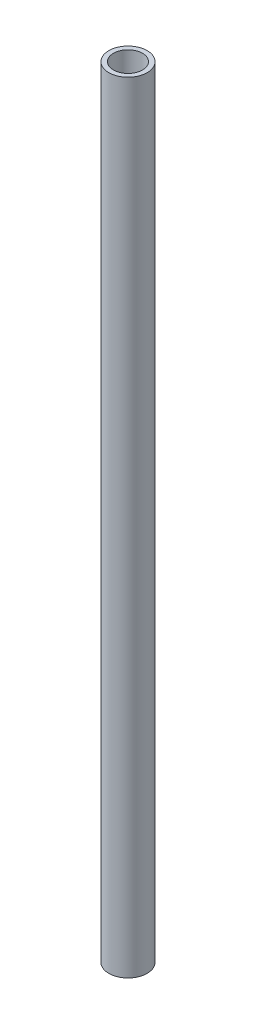
ISO-10303-21;
HEADER;
FILE_DESCRIPTION(('STEP AP214'),'2;1');
FILE_NAME('part.step','',(''),(''),'','','');
FILE_SCHEMA(('AUTOMOTIVE_DESIGN { 1 0 10303 214 1 1 1 1 }'));
ENDSEC;
DATA;
#1=APPLICATION_CONTEXT('core data for automotive mechanical design processes');
#2=APPLICATION_PROTOCOL_DEFINITION('international standard','automotive_design',2000,#1);
#3=PRODUCT_CONTEXT('',#1,'mechanical');
#4=PRODUCT('Part','Part','',(#3));
#5=PRODUCT_RELATED_PRODUCT_CATEGORY('part','',(#4));
#6=PRODUCT_DEFINITION_FORMATION('','',#4);
#7=PRODUCT_DEFINITION_CONTEXT('part definition',#1,'design');
#8=PRODUCT_DEFINITION('design','',#6,#7);
#9=PRODUCT_DEFINITION_SHAPE('','',#8);
#10=(LENGTH_UNIT() NAMED_UNIT(*) SI_UNIT(.MILLI.,.METRE.));
#11=(NAMED_UNIT(*) PLANE_ANGLE_UNIT() SI_UNIT($,.RADIAN.));
#12=(NAMED_UNIT(*) SI_UNIT($,.STERADIAN.) SOLID_ANGLE_UNIT());
#13=UNCERTAINTY_MEASURE_WITH_UNIT(LENGTH_MEASURE(1.E-05),#10,'distance_accuracy_value','');
#14=(GEOMETRIC_REPRESENTATION_CONTEXT(3) GLOBAL_UNCERTAINTY_ASSIGNED_CONTEXT((#13)) GLOBAL_UNIT_ASSIGNED_CONTEXT((#10,
#11,#12)) REPRESENTATION_CONTEXT('',''));
#15=CARTESIAN_POINT('',(0.,0.,0.));
#16=DIRECTION('',(0.,0.,1.));
#17=DIRECTION('',(1.,0.,0.));
#18=AXIS2_PLACEMENT_3D('',#15,#16,#17);
#19=CARTESIAN_POINT('',(0.,550.,0.));
#20=DIRECTION('',(0.,1.,0.));
#21=DIRECTION('',(0.,0.,1.));
#22=AXIS2_PLACEMENT_3D('',#19,#20,#21);
#23=PLANE('',#22);
#24=CARTESIAN_POINT('',(0.,550.,0.));
#25=DIRECTION('',(0.,1.,0.));
#26=DIRECTION('',(0.,0.,1.));
#27=AXIS2_PLACEMENT_3D('',#24,#25,#26);
#28=CIRCLE('',#27,13.5);
#29=CARTESIAN_POINT('',(0.,550.,13.5));
#30=VERTEX_POINT('',#29);
#31=EDGE_CURVE('E10',#30,#30,#28,.T.);
#32=ORIENTED_EDGE('',*,*,#31,.T.);
#33=EDGE_LOOP('',(#32));
#34=FACE_BOUND('',#33,.T.);
#35=CARTESIAN_POINT('',(0.,550.,0.));
#36=DIRECTION('',(0.,1.,0.));
#37=DIRECTION('',(0.,0.,1.));
#38=AXIS2_PLACEMENT_3D('',#35,#36,#37);
#39=CIRCLE('',#38,10.25);
#40=CARTESIAN_POINT('',(0.,550.,10.25));
#41=VERTEX_POINT('',#40);
#42=EDGE_CURVE('E41',#41,#41,#39,.T.);
#43=ORIENTED_EDGE('',*,*,#42,.F.);
#44=EDGE_LOOP('',(#43));
#45=FACE_BOUND('',#44,.T.);
#46=ADVANCED_FACE('F30',(#34,#45),#23,.T.);
#47=CARTESIAN_POINT('',(0.,0.,0.));
#48=DIRECTION('',(0.,1.,0.));
#49=DIRECTION('',(0.,0.,1.));
#50=AXIS2_PLACEMENT_3D('',#47,#48,#49);
#51=PLANE('',#50);
#52=CARTESIAN_POINT('',(0.,0.,0.));
#53=DIRECTION('',(0.,1.,0.));
#54=DIRECTION('',(0.,0.,1.));
#55=AXIS2_PLACEMENT_3D('',#52,#53,#54);
#56=CIRCLE('',#55,13.5);
#57=CARTESIAN_POINT('',(0.,0.,13.5));
#58=VERTEX_POINT('',#57);
#59=EDGE_CURVE('E34',#58,#58,#56,.T.);
#60=ORIENTED_EDGE('',*,*,#59,.F.);
#61=EDGE_LOOP('',(#60));
#62=FACE_BOUND('',#61,.T.);
#63=CARTESIAN_POINT('',(0.,0.,0.));
#64=DIRECTION('',(0.,1.,0.));
#65=DIRECTION('',(0.,0.,1.));
#66=AXIS2_PLACEMENT_3D('',#63,#64,#65);
#67=CIRCLE('',#66,10.25);
#68=CARTESIAN_POINT('',(0.,0.,10.25));
#69=VERTEX_POINT('',#68);
#70=EDGE_CURVE('E43',#69,#69,#67,.T.);
#71=ORIENTED_EDGE('',*,*,#70,.T.);
#72=EDGE_LOOP('',(#71));
#73=FACE_BOUND('',#72,.T.);
#74=ADVANCED_FACE('F53',(#62,#73),#51,.F.);
#75=CARTESIAN_POINT('',(0.,550.,0.));
#76=DIRECTION('',(0.,-1.,0.));
#77=DIRECTION('',(0.,0.,-1.));
#78=AXIS2_PLACEMENT_3D('',#75,#76,#77);
#79=CYLINDRICAL_SURFACE('',#78,13.5);
#80=ORIENTED_EDGE('',*,*,#31,.F.);
#81=EDGE_LOOP('',(#80));
#82=FACE_BOUND('',#81,.T.);
#83=ORIENTED_EDGE('',*,*,#59,.T.);
#84=EDGE_LOOP('',(#83));
#85=FACE_BOUND('',#84,.T.);
#86=ADVANCED_FACE('F32',(#82,#85),#79,.T.);
#87=CARTESIAN_POINT('',(0.,550.,0.));
#88=DIRECTION('',(0.,-1.,0.));
#89=DIRECTION('',(0.,0.,-1.));
#90=AXIS2_PLACEMENT_3D('',#87,#88,#89);
#91=CYLINDRICAL_SURFACE('',#90,10.25);
#92=ORIENTED_EDGE('',*,*,#42,.T.);
#93=EDGE_LOOP('',(#92));
#94=FACE_BOUND('',#93,.T.);
#95=ORIENTED_EDGE('',*,*,#70,.F.);
#96=EDGE_LOOP('',(#95));
#97=FACE_BOUND('',#96,.T.);
#98=ADVANCED_FACE('F49',(#94,#97),#91,.F.);
#99=CLOSED_SHELL('',(#46,#74,#86,#98));
#100=MANIFOLD_SOLID_BREP('B2',#99);
#101=ADVANCED_BREP_SHAPE_REPRESENTATION('',(#18,#100),#14);
#102=SHAPE_DEFINITION_REPRESENTATION(#9,#101);
ENDSEC;
END-ISO-10303-21;
